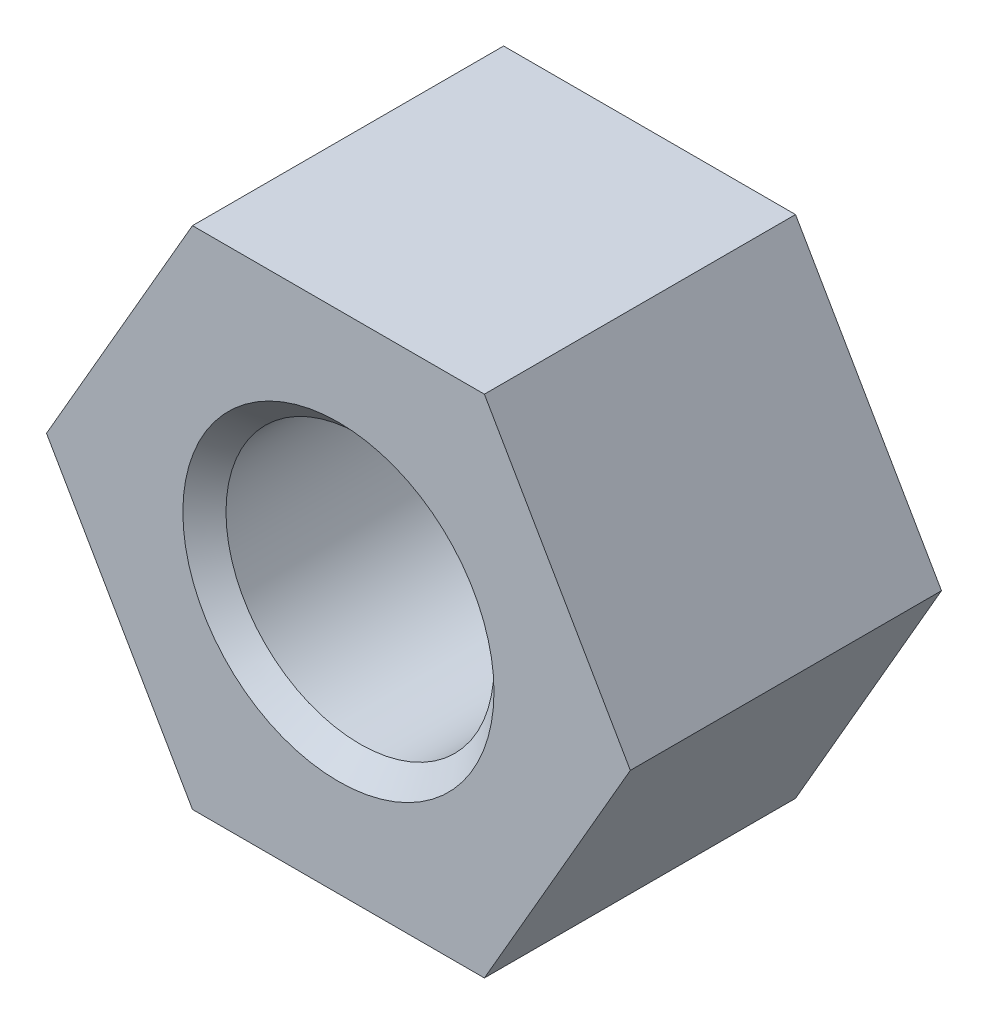
ISO-10303-21;
HEADER;
FILE_DESCRIPTION(('STEP AP214'),'2;1');
FILE_NAME('part.step','',(''),(''),'','','');
FILE_SCHEMA(('AUTOMOTIVE_DESIGN { 1 0 10303 214 1 1 1 1 }'));
ENDSEC;
DATA;
#1=APPLICATION_CONTEXT('core data for automotive mechanical design processes');
#2=APPLICATION_PROTOCOL_DEFINITION('international standard','automotive_design',2000,#1);
#3=PRODUCT_CONTEXT('',#1,'mechanical');
#4=PRODUCT('Part','Part','',(#3));
#5=PRODUCT_RELATED_PRODUCT_CATEGORY('part','',(#4));
#6=PRODUCT_DEFINITION_FORMATION('','',#4);
#7=PRODUCT_DEFINITION_CONTEXT('part definition',#1,'design');
#8=PRODUCT_DEFINITION('design','',#6,#7);
#9=PRODUCT_DEFINITION_SHAPE('','',#8);
#10=(LENGTH_UNIT() NAMED_UNIT(*) SI_UNIT(.MILLI.,.METRE.));
#11=(NAMED_UNIT(*) PLANE_ANGLE_UNIT() SI_UNIT($,.RADIAN.));
#12=(NAMED_UNIT(*) SI_UNIT($,.STERADIAN.) SOLID_ANGLE_UNIT());
#13=UNCERTAINTY_MEASURE_WITH_UNIT(LENGTH_MEASURE(1.E-05),#10,'distance_accuracy_value','');
#14=(GEOMETRIC_REPRESENTATION_CONTEXT(3) GLOBAL_UNCERTAINTY_ASSIGNED_CONTEXT((#13)) GLOBAL_UNIT_ASSIGNED_CONTEXT((#10,
#11,#12)) REPRESENTATION_CONTEXT('',''));
#15=CARTESIAN_POINT('',(0.,0.,0.));
#16=DIRECTION('',(0.,0.,1.));
#17=DIRECTION('',(1.,0.,0.));
#18=AXIS2_PLACEMENT_3D('',#15,#16,#17);
#19=CARTESIAN_POINT('',(0.,0.,8.00000000000001));
#20=DIRECTION('',(0.,0.,1.));
#21=DIRECTION('',(1.,0.,0.));
#22=AXIS2_PLACEMENT_3D('',#19,#20,#21);
#23=PLANE('',#22);
#24=CARTESIAN_POINT('',(0.,0.,8.00000000000001));
#25=DIRECTION('',(0.,0.,1.));
#26=DIRECTION('',(1.,0.,0.));
#27=AXIS2_PLACEMENT_3D('',#24,#25,#26);
#28=CIRCLE('',#27,4.);
#29=CARTESIAN_POINT('',(4.00000000000001,0.,8.00000000000001));
#30=VERTEX_POINT('',#29);
#31=EDGE_CURVE('E11',#30,#30,#28,.F.);
#32=ORIENTED_EDGE('',*,*,#31,.T.);
#33=EDGE_LOOP('',(#32));
#34=FACE_BOUND('',#33,.T.);
#35=DIRECTION('',(-0.5,0.866025403784439,0.));
#36=VECTOR('',#35,1.);
#37=CARTESIAN_POINT('',(7.50555349946514,0.,8.00000000000004));
#38=LINE('',#37,#36);
#39=CARTESIAN_POINT('',(7.50555349946514,0.,8.00000000000004));
#40=VERTEX_POINT('',#39);
#41=CARTESIAN_POINT('',(3.75277674973257,6.50000000000001,8.00000000000001));
#42=VERTEX_POINT('',#41);
#43=EDGE_CURVE('E131',#40,#42,#38,.T.);
#44=ORIENTED_EDGE('',*,*,#43,.T.);
#45=DIRECTION('',(-1.,0.,0.));
#46=VECTOR('',#45,1.);
#47=CARTESIAN_POINT('',(3.75277674973257,6.50000000000001,8.00000000000001));
#48=LINE('',#47,#46);
#49=CARTESIAN_POINT('',(-3.75277674973257,6.50000000000002,8.00000000000001));
#50=VERTEX_POINT('',#49);
#51=EDGE_CURVE('E91',#42,#50,#48,.T.);
#52=ORIENTED_EDGE('',*,*,#51,.T.);
#53=DIRECTION('',(-0.5,-0.866025403784439,0.));
#54=VECTOR('',#53,1.);
#55=CARTESIAN_POINT('',(-3.75277674973257,6.50000000000002,8.00000000000001));
#56=LINE('',#55,#54);
#57=CARTESIAN_POINT('',(-7.50555349946513,0.,8.00000000000001));
#58=VERTEX_POINT('',#57);
#59=EDGE_CURVE('E103',#50,#58,#56,.T.);
#60=ORIENTED_EDGE('',*,*,#59,.T.);
#61=DIRECTION('',(0.5,-0.86602540378444,0.));
#62=VECTOR('',#61,1.);
#63=CARTESIAN_POINT('',(-7.50555349946513,0.,8.00000000000001));
#64=LINE('',#63,#62);
#65=CARTESIAN_POINT('',(-3.75277674973256,-6.5,8.00000000000001));
#66=VERTEX_POINT('',#65);
#67=EDGE_CURVE('E98',#58,#66,#64,.T.);
#68=ORIENTED_EDGE('',*,*,#67,.T.);
#69=DIRECTION('',(1.,0.,0.));
#70=VECTOR('',#69,1.);
#71=CARTESIAN_POINT('',(-3.75277674973256,-6.5,8.00000000000001));
#72=LINE('',#71,#70);
#73=CARTESIAN_POINT('',(3.75277674973257,-6.5,8.00000000000004));
#74=VERTEX_POINT('',#73);
#75=EDGE_CURVE('E101',#66,#74,#72,.T.);
#76=ORIENTED_EDGE('',*,*,#75,.T.);
#77=DIRECTION('',(0.5,0.866025403784439,0.));
#78=VECTOR('',#77,1.);
#79=CARTESIAN_POINT('',(3.75277674973257,-6.5,8.00000000000004));
#80=LINE('',#79,#78);
#81=EDGE_CURVE('E53',#74,#40,#80,.T.);
#82=ORIENTED_EDGE('',*,*,#81,.T.);
#83=EDGE_LOOP('',(#44,#52,#60,#68,#76,#82));
#84=FACE_BOUND('',#83,.T.);
#85=ADVANCED_FACE('F36',(#34,#84),#23,.T.);
#86=CARTESIAN_POINT('',(0.,0.,0.));
#87=DIRECTION('',(0.,0.,1.));
#88=DIRECTION('',(1.,0.,0.));
#89=AXIS2_PLACEMENT_3D('',#86,#87,#88);
#90=PLANE('',#89);
#91=CARTESIAN_POINT('',(0.,0.,0.));
#92=DIRECTION('',(0.,0.,1.));
#93=DIRECTION('',(1.,0.,0.));
#94=AXIS2_PLACEMENT_3D('',#91,#92,#93);
#95=CIRCLE('',#94,4.);
#96=CARTESIAN_POINT('',(4.,0.,0.));
#97=VERTEX_POINT('',#96);
#98=EDGE_CURVE('E140',#97,#97,#95,.T.);
#99=ORIENTED_EDGE('',*,*,#98,.T.);
#100=EDGE_LOOP('',(#99));
#101=FACE_BOUND('',#100,.T.);
#102=DIRECTION('',(-0.5,0.866025403784439,0.));
#103=VECTOR('',#102,1.);
#104=CARTESIAN_POINT('',(7.50555349946514,0.,0.));
#105=LINE('',#104,#103);
#106=CARTESIAN_POINT('',(7.50555349946514,0.,0.));
#107=VERTEX_POINT('',#106);
#108=CARTESIAN_POINT('',(3.75277674973257,6.50000000000001,0.));
#109=VERTEX_POINT('',#108);
#110=EDGE_CURVE('E121',#107,#109,#105,.T.);
#111=ORIENTED_EDGE('',*,*,#110,.F.);
#112=DIRECTION('',(0.5,0.866025403784439,0.));
#113=VECTOR('',#112,1.);
#114=CARTESIAN_POINT('',(3.75277674973257,-6.50000000000001,0.));
#115=LINE('',#114,#113);
#116=CARTESIAN_POINT('',(3.75277674973257,-6.50000000000001,0.));
#117=VERTEX_POINT('',#116);
#118=EDGE_CURVE('E82',#117,#107,#115,.T.);
#119=ORIENTED_EDGE('',*,*,#118,.F.);
#120=DIRECTION('',(1.,0.,0.));
#121=VECTOR('',#120,1.);
#122=CARTESIAN_POINT('',(-3.75277674973256,-6.50000000000001,0.));
#123=LINE('',#122,#121);
#124=CARTESIAN_POINT('',(-3.75277674973256,-6.50000000000001,0.));
#125=VERTEX_POINT('',#124);
#126=EDGE_CURVE('E76',#125,#117,#123,.T.);
#127=ORIENTED_EDGE('',*,*,#126,.F.);
#128=DIRECTION('',(0.5,-0.86602540378444,0.));
#129=VECTOR('',#128,1.);
#130=CARTESIAN_POINT('',(-7.50555349946513,0.,0.));
#131=LINE('',#130,#129);
#132=CARTESIAN_POINT('',(-7.50555349946513,0.,0.));
#133=VERTEX_POINT('',#132);
#134=EDGE_CURVE('E111',#133,#125,#131,.T.);
#135=ORIENTED_EDGE('',*,*,#134,.F.);
#136=DIRECTION('',(-0.5,-0.866025403784439,0.));
#137=VECTOR('',#136,1.);
#138=CARTESIAN_POINT('',(-3.75277674973257,6.50000000000001,0.));
#139=LINE('',#138,#137);
#140=CARTESIAN_POINT('',(-3.75277674973257,6.50000000000001,0.));
#141=VERTEX_POINT('',#140);
#142=EDGE_CURVE('E126',#141,#133,#139,.T.);
#143=ORIENTED_EDGE('',*,*,#142,.F.);
#144=DIRECTION('',(-1.,0.,0.));
#145=VECTOR('',#144,1.);
#146=CARTESIAN_POINT('',(3.75277674973257,6.50000000000001,0.));
#147=LINE('',#146,#145);
#148=EDGE_CURVE('E124',#109,#141,#147,.T.);
#149=ORIENTED_EDGE('',*,*,#148,.F.);
#150=EDGE_LOOP('',(#111,#119,#127,#135,#143,#149));
#151=FACE_BOUND('',#150,.T.);
#152=ADVANCED_FACE('F156',(#101,#151),#90,.F.);
#153=CARTESIAN_POINT('',(7.50555349946514,0.,8.00000000000004));
#154=DIRECTION('',(-0.866025403784439,-0.5,0.));
#155=DIRECTION('',(0.5,-0.866025403784439,0.));
#156=AXIS2_PLACEMENT_3D('',#153,#154,#155);
#157=PLANE('',#156);
#158=ORIENTED_EDGE('',*,*,#110,.T.);
#159=DIRECTION('',(0.,0.,-1.));
#160=VECTOR('',#159,1.);
#161=CARTESIAN_POINT('',(3.75277674973257,6.50000000000001,8.00000000000001));
#162=LINE('',#161,#160);
#163=EDGE_CURVE('E138',#42,#109,#162,.T.);
#164=ORIENTED_EDGE('',*,*,#163,.F.);
#165=ORIENTED_EDGE('',*,*,#43,.F.);
#166=DIRECTION('',(0.,0.,-1.));
#167=VECTOR('',#166,1.);
#168=CARTESIAN_POINT('',(7.50555349946514,0.,8.00000000000004));
#169=LINE('',#168,#167);
#170=EDGE_CURVE('E117',#40,#107,#169,.T.);
#171=ORIENTED_EDGE('',*,*,#170,.T.);
#172=EDGE_LOOP('',(#158,#164,#165,#171));
#173=FACE_BOUND('',#172,.T.);
#174=ADVANCED_FACE('F159',(#173),#157,.F.);
#175=CARTESIAN_POINT('',(3.75277674973257,6.50000000000001,8.00000000000001));
#176=DIRECTION('',(0.,-1.,0.));
#177=DIRECTION('',(1.,0.,0.));
#178=AXIS2_PLACEMENT_3D('',#175,#176,#177);
#179=PLANE('',#178);
#180=ORIENTED_EDGE('',*,*,#148,.T.);
#181=DIRECTION('',(0.,0.,-1.));
#182=VECTOR('',#181,1.);
#183=CARTESIAN_POINT('',(-3.75277674973257,6.50000000000002,8.00000000000001));
#184=LINE('',#183,#182);
#185=EDGE_CURVE('E135',#50,#141,#184,.T.);
#186=ORIENTED_EDGE('',*,*,#185,.F.);
#187=ORIENTED_EDGE('',*,*,#51,.F.);
#188=ORIENTED_EDGE('',*,*,#163,.T.);
#189=EDGE_LOOP('',(#180,#186,#187,#188));
#190=FACE_BOUND('',#189,.T.);
#191=ADVANCED_FACE('F217',(#190),#179,.F.);
#192=CARTESIAN_POINT('',(-3.75277674973257,6.50000000000002,8.00000000000001));
#193=DIRECTION('',(0.866025403784439,-0.500000000000001,0.));
#194=DIRECTION('',(0.5,0.866025403784439,0.));
#195=AXIS2_PLACEMENT_3D('',#192,#193,#194);
#196=PLANE('',#195);
#197=ORIENTED_EDGE('',*,*,#142,.T.);
#198=DIRECTION('',(0.,0.,-1.));
#199=VECTOR('',#198,1.);
#200=CARTESIAN_POINT('',(-7.50555349946513,0.,8.00000000000001));
#201=LINE('',#200,#199);
#202=EDGE_CURVE('E112',#58,#133,#201,.T.);
#203=ORIENTED_EDGE('',*,*,#202,.F.);
#204=ORIENTED_EDGE('',*,*,#59,.F.);
#205=ORIENTED_EDGE('',*,*,#185,.T.);
#206=EDGE_LOOP('',(#197,#203,#204,#205));
#207=FACE_BOUND('',#206,.T.);
#208=ADVANCED_FACE('F210',(#207),#196,.F.);
#209=CARTESIAN_POINT('',(-7.50555349946513,0.,8.00000000000001));
#210=DIRECTION('',(0.866025403784439,0.5,0.));
#211=DIRECTION('',(-0.5,0.86602540378444,0.));
#212=AXIS2_PLACEMENT_3D('',#209,#210,#211);
#213=PLANE('',#212);
#214=ORIENTED_EDGE('',*,*,#134,.T.);
#215=DIRECTION('',(0.,0.,-1.));
#216=VECTOR('',#215,1.);
#217=CARTESIAN_POINT('',(-3.75277674973256,-6.5,8.00000000000001));
#218=LINE('',#217,#216);
#219=EDGE_CURVE('E108',#66,#125,#218,.T.);
#220=ORIENTED_EDGE('',*,*,#219,.F.);
#221=ORIENTED_EDGE('',*,*,#67,.F.);
#222=ORIENTED_EDGE('',*,*,#202,.T.);
#223=EDGE_LOOP('',(#214,#220,#221,#222));
#224=FACE_BOUND('',#223,.T.);
#225=ADVANCED_FACE('F109',(#224),#213,.F.);
#226=CARTESIAN_POINT('',(-3.75277674973256,-6.5,8.00000000000001));
#227=DIRECTION('',(0.,1.,0.));
#228=DIRECTION('',(0.,0.,1.));
#229=AXIS2_PLACEMENT_3D('',#226,#227,#228);
#230=PLANE('',#229);
#231=ORIENTED_EDGE('',*,*,#126,.T.);
#232=DIRECTION('',(0.,0.,-1.));
#233=VECTOR('',#232,1.);
#234=CARTESIAN_POINT('',(3.75277674973257,-6.5,8.00000000000004));
#235=LINE('',#234,#233);
#236=EDGE_CURVE('E113',#74,#117,#235,.T.);
#237=ORIENTED_EDGE('',*,*,#236,.F.);
#238=ORIENTED_EDGE('',*,*,#75,.F.);
#239=ORIENTED_EDGE('',*,*,#219,.T.);
#240=EDGE_LOOP('',(#231,#237,#238,#239));
#241=FACE_BOUND('',#240,.T.);
#242=ADVANCED_FACE('F115',(#241),#230,.F.);
#243=CARTESIAN_POINT('',(3.75277674973257,-6.5,8.00000000000004));
#244=DIRECTION('',(-0.866025403784439,0.500000000000001,0.));
#245=DIRECTION('',(-0.5,-0.866025403784439,0.));
#246=AXIS2_PLACEMENT_3D('',#243,#244,#245);
#247=PLANE('',#246);
#248=ORIENTED_EDGE('',*,*,#118,.T.);
#249=ORIENTED_EDGE('',*,*,#170,.F.);
#250=ORIENTED_EDGE('',*,*,#81,.F.);
#251=ORIENTED_EDGE('',*,*,#236,.T.);
#252=EDGE_LOOP('',(#248,#249,#250,#251));
#253=FACE_BOUND('',#252,.T.);
#254=ADVANCED_FACE('F166',(#253),#247,.F.);
#255=CARTESIAN_POINT('',(0.,0.,8.00000000000001));
#256=DIRECTION('',(0.,0.,-1.));
#257=DIRECTION('',(-1.,0.,0.));
#258=AXIS2_PLACEMENT_3D('',#255,#256,#257);
#259=CYLINDRICAL_SURFACE('',#258,3.4455);
#260=CARTESIAN_POINT('',(0.,0.,0.554500000000013));
#261=DIRECTION('',(0.,0.,1.));
#262=DIRECTION('',(1.,0.,0.));
#263=AXIS2_PLACEMENT_3D('',#260,#261,#262);
#264=CIRCLE('',#263,3.4455);
#265=CARTESIAN_POINT('',(3.4455,0.,0.554500000000013));
#266=VERTEX_POINT('',#265);
#267=EDGE_CURVE('E45',#266,#266,#264,.F.);
#268=ORIENTED_EDGE('',*,*,#267,.T.);
#269=EDGE_LOOP('',(#268));
#270=FACE_BOUND('',#269,.T.);
#271=CARTESIAN_POINT('',(0.,0.,7.44549999999999));
#272=DIRECTION('',(0.,0.,1.));
#273=DIRECTION('',(1.,0.,0.));
#274=AXIS2_PLACEMENT_3D('',#271,#272,#273);
#275=CIRCLE('',#274,3.4455);
#276=CARTESIAN_POINT('',(3.4455,0.,7.44549999999999));
#277=VERTEX_POINT('',#276);
#278=EDGE_CURVE('E143',#277,#277,#275,.T.);
#279=ORIENTED_EDGE('',*,*,#278,.T.);
#280=EDGE_LOOP('',(#279));
#281=FACE_BOUND('',#280,.T.);
#282=ADVANCED_FACE('F148',(#270,#281),#259,.F.);
#283=CARTESIAN_POINT('',(0.,0.,0.));
#284=DIRECTION('',(0.,0.,-1.));
#285=DIRECTION('',(-1.,0.,0.));
#286=AXIS2_PLACEMENT_3D('',#283,#284,#285);
#287=CONICAL_SURFACE('',#286,4.,0.785398163397446);
#288=ORIENTED_EDGE('',*,*,#267,.F.);
#289=EDGE_LOOP('',(#288));
#290=FACE_BOUND('',#289,.T.);
#291=ORIENTED_EDGE('',*,*,#98,.F.);
#292=EDGE_LOOP('',(#291));
#293=FACE_BOUND('',#292,.T.);
#294=ADVANCED_FACE('F151',(#290,#293),#287,.F.);
#295=CARTESIAN_POINT('',(0.,0.,7.44549999999999));
#296=DIRECTION('',(0.,0.,1.));
#297=DIRECTION('',(1.,0.,0.));
#298=AXIS2_PLACEMENT_3D('',#295,#296,#297);
#299=CONICAL_SURFACE('',#298,3.4455,0.78539816339745);
#300=ORIENTED_EDGE('',*,*,#31,.F.);
#301=EDGE_LOOP('',(#300));
#302=FACE_BOUND('',#301,.T.);
#303=ORIENTED_EDGE('',*,*,#278,.F.);
#304=EDGE_LOOP('',(#303));
#305=FACE_BOUND('',#304,.T.);
#306=ADVANCED_FACE('F38',(#302,#305),#299,.F.);
#307=CLOSED_SHELL('',(#85,#152,#174,#191,#208,#225,#242,#254,#282,#294,#306));
#308=MANIFOLD_SOLID_BREP('B2',#307);
#309=ADVANCED_BREP_SHAPE_REPRESENTATION('',(#18,#308),#14);
#310=SHAPE_DEFINITION_REPRESENTATION(#9,#309);
ENDSEC;
END-ISO-10303-21;
